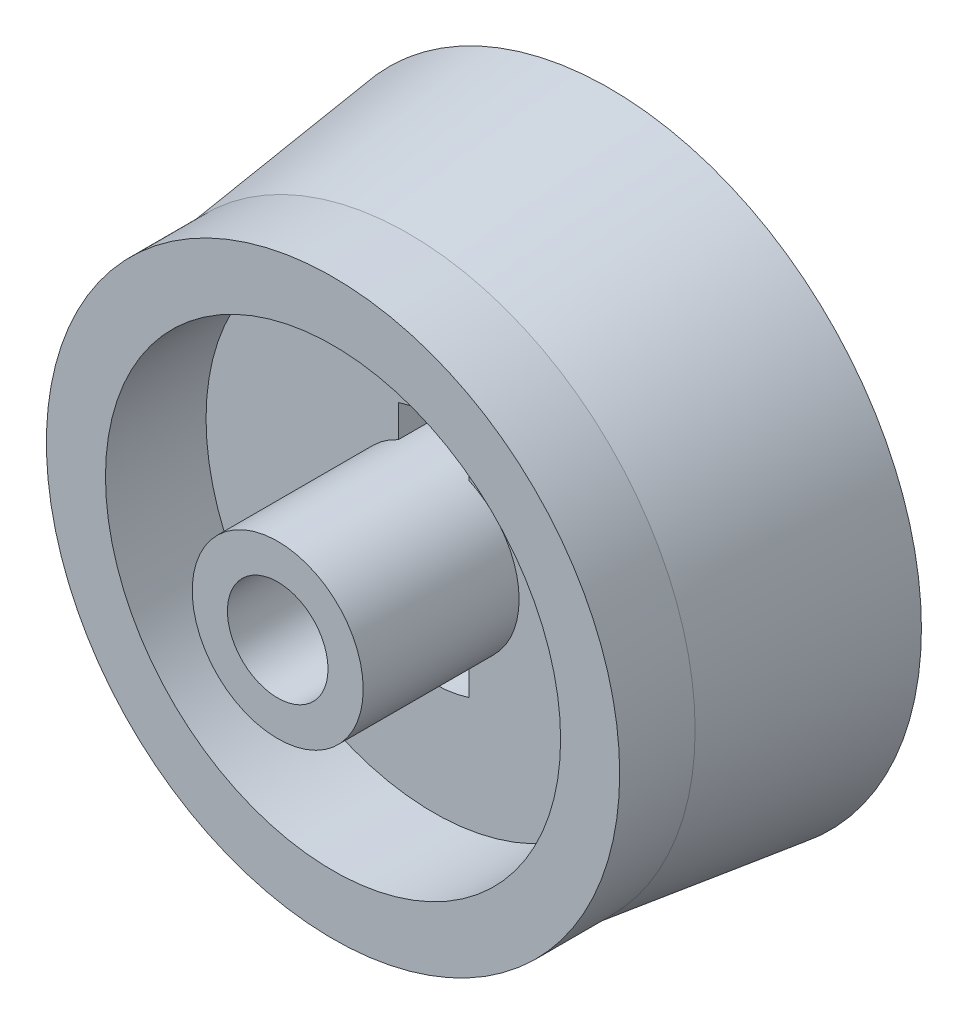
ISO-10303-21;
HEADER;
FILE_DESCRIPTION(('STEP AP214'),'2;1');
FILE_NAME('part.step','',(''),(''),'','','');
FILE_SCHEMA(('AUTOMOTIVE_DESIGN { 1 0 10303 214 1 1 1 1 }'));
ENDSEC;
DATA;
#1=APPLICATION_CONTEXT('core data for automotive mechanical design processes');
#2=APPLICATION_PROTOCOL_DEFINITION('international standard','automotive_design',2000,#1);
#3=PRODUCT_CONTEXT('',#1,'mechanical');
#4=PRODUCT('Part','Part','',(#3));
#5=PRODUCT_RELATED_PRODUCT_CATEGORY('part','',(#4));
#6=PRODUCT_DEFINITION_FORMATION('','',#4);
#7=PRODUCT_DEFINITION_CONTEXT('part definition',#1,'design');
#8=PRODUCT_DEFINITION('design','',#6,#7);
#9=PRODUCT_DEFINITION_SHAPE('','',#8);
#10=(LENGTH_UNIT() NAMED_UNIT(*) SI_UNIT(.MILLI.,.METRE.));
#11=(NAMED_UNIT(*) PLANE_ANGLE_UNIT() SI_UNIT($,.RADIAN.));
#12=(NAMED_UNIT(*) SI_UNIT($,.STERADIAN.) SOLID_ANGLE_UNIT());
#13=UNCERTAINTY_MEASURE_WITH_UNIT(LENGTH_MEASURE(1.E-05),#10,'distance_accuracy_value','');
#14=(GEOMETRIC_REPRESENTATION_CONTEXT(3) GLOBAL_UNCERTAINTY_ASSIGNED_CONTEXT((#13)) GLOBAL_UNIT_ASSIGNED_CONTEXT((#10,
#11,#12)) REPRESENTATION_CONTEXT('',''));
#15=CARTESIAN_POINT('',(0.,0.,0.));
#16=DIRECTION('',(0.,0.,1.));
#17=DIRECTION('',(1.,0.,0.));
#18=AXIS2_PLACEMENT_3D('',#15,#16,#17);
#19=CARTESIAN_POINT('',(0.,0.,1000.));
#20=DIRECTION('',(0.,0.,1.));
#21=DIRECTION('',(1.,0.,0.));
#22=AXIS2_PLACEMENT_3D('',#19,#20,#21);
#23=CYLINDRICAL_SURFACE('',#22,4.9);
#24=CARTESIAN_POINT('',(0.,0.,-3.20000000000009));
#25=DIRECTION('',(0.,0.,-1.));
#26=DIRECTION('',(-1.,0.,0.));
#27=AXIS2_PLACEMENT_3D('',#24,#25,#26);
#28=CIRCLE('',#27,4.9);
#29=CARTESIAN_POINT('',(-4.9,0.,-3.20000000000009));
#30=VERTEX_POINT('',#29);
#31=EDGE_CURVE('E154',#30,#30,#28,.T.);
#32=ORIENTED_EDGE('',*,*,#31,.F.);
#33=EDGE_LOOP('',(#32));
#34=FACE_BOUND('',#33,.T.);
#35=CARTESIAN_POINT('',(0.,0.,-4.79999999999992));
#36=DIRECTION('',(0.,0.,-1.));
#37=DIRECTION('',(-1.,0.,0.));
#38=AXIS2_PLACEMENT_3D('',#35,#36,#37);
#39=CIRCLE('',#38,4.9);
#40=CARTESIAN_POINT('',(-4.9,0.,-4.79999999999992));
#41=VERTEX_POINT('',#40);
#42=EDGE_CURVE('E41',#41,#41,#39,.F.);
#43=ORIENTED_EDGE('',*,*,#42,.F.);
#44=EDGE_LOOP('',(#43));
#45=FACE_BOUND('',#44,.T.);
#46=ADVANCED_FACE('F37',(#34,#45),#23,.F.);
#47=CARTESIAN_POINT('',(0.,0.,-3.2));
#48=DIRECTION('',(0.,0.,-1.));
#49=DIRECTION('',(-1.,0.,0.));
#50=AXIS2_PLACEMENT_3D('',#47,#48,#49);
#51=PLANE('',#50);
#52=DIRECTION('',(0.,1.,0.));
#53=VECTOR('',#52,1.);
#54=CARTESIAN_POINT('',(0.7,0.,-3.2));
#55=LINE('',#54,#53);
#56=CARTESIAN_POINT('',(0.7,-2.19089023002066,-3.2));
#57=VERTEX_POINT('',#56);
#58=CARTESIAN_POINT('',(0.7,-1.54919333848297,-3.2));
#59=VERTEX_POINT('',#58);
#60=EDGE_CURVE('E123',#57,#59,#55,.T.);
#61=ORIENTED_EDGE('',*,*,#60,.T.);
#62=CARTESIAN_POINT('',(0.,0.,-3.2));
#63=DIRECTION('',(0.,0.,-1.));
#64=DIRECTION('',(-1.,0.,0.));
#65=AXIS2_PLACEMENT_3D('',#62,#63,#64);
#66=CIRCLE('',#65,1.7);
#67=CARTESIAN_POINT('',(-0.7,-1.54919333848297,-3.2));
#68=VERTEX_POINT('',#67);
#69=EDGE_CURVE('E159',#59,#68,#66,.T.);
#70=ORIENTED_EDGE('',*,*,#69,.T.);
#71=DIRECTION('',(0.,1.,0.));
#72=VECTOR('',#71,1.);
#73=CARTESIAN_POINT('',(-0.7,0.,-3.2));
#74=LINE('',#73,#72);
#75=CARTESIAN_POINT('',(-0.7,-2.19089023002066,-3.2));
#76=VERTEX_POINT('',#75);
#77=EDGE_CURVE('E109',#76,#68,#74,.T.);
#78=ORIENTED_EDGE('',*,*,#77,.F.);
#79=CARTESIAN_POINT('',(0.,0.,-3.2));
#80=DIRECTION('',(0.,0.,-1.));
#81=DIRECTION('',(-1.,0.,0.));
#82=AXIS2_PLACEMENT_3D('',#79,#80,#81);
#83=CIRCLE('',#82,2.3);
#84=EDGE_CURVE('E166',#57,#76,#83,.T.);
#85=ORIENTED_EDGE('',*,*,#84,.F.);
#86=EDGE_LOOP('',(#61,#70,#78,#85));
#87=FACE_BOUND('',#86,.T.);
#88=CARTESIAN_POINT('',(0.,0.,-3.2));
#89=DIRECTION('',(0.,0.,-1.));
#90=DIRECTION('',(-1.,0.,0.));
#91=AXIS2_PLACEMENT_3D('',#88,#89,#90);
#92=CIRCLE('',#91,2.3);
#93=CARTESIAN_POINT('',(-0.7,2.19089023002066,-3.2));
#94=VERTEX_POINT('',#93);
#95=CARTESIAN_POINT('',(0.7,2.19089023002066,-3.2));
#96=VERTEX_POINT('',#95);
#97=EDGE_CURVE('E172',#94,#96,#92,.T.);
#98=ORIENTED_EDGE('',*,*,#97,.F.);
#99=DIRECTION('',(0.,1.,0.));
#100=VECTOR('',#99,1.);
#101=CARTESIAN_POINT('',(-0.7,0.,-3.2));
#102=LINE('',#101,#100);
#103=CARTESIAN_POINT('',(-0.7,1.54919333848297,-3.2));
#104=VERTEX_POINT('',#103);
#105=EDGE_CURVE('E170',#104,#94,#102,.T.);
#106=ORIENTED_EDGE('',*,*,#105,.F.);
#107=CARTESIAN_POINT('',(0.,0.,-3.2));
#108=DIRECTION('',(0.,0.,-1.));
#109=DIRECTION('',(-1.,0.,0.));
#110=AXIS2_PLACEMENT_3D('',#107,#108,#109);
#111=CIRCLE('',#110,1.7);
#112=CARTESIAN_POINT('',(0.7,1.54919333848297,-3.2));
#113=VERTEX_POINT('',#112);
#114=EDGE_CURVE('E178',#104,#113,#111,.T.);
#115=ORIENTED_EDGE('',*,*,#114,.T.);
#116=DIRECTION('',(0.,1.,0.));
#117=VECTOR('',#116,1.);
#118=CARTESIAN_POINT('',(0.7,0.,-3.2));
#119=LINE('',#118,#117);
#120=EDGE_CURVE('E175',#113,#96,#119,.T.);
#121=ORIENTED_EDGE('',*,*,#120,.T.);
#122=EDGE_LOOP('',(#98,#106,#115,#121));
#123=FACE_BOUND('',#122,.T.);
#124=CARTESIAN_POINT('',(0.,0.,-3.2));
#125=DIRECTION('',(0.,0.,-1.));
#126=DIRECTION('',(-1.,0.,0.));
#127=AXIS2_PLACEMENT_3D('',#124,#125,#126);
#128=CIRCLE('',#127,1.15);
#129=CARTESIAN_POINT('',(-1.15,0.,-3.2));
#130=VERTEX_POINT('',#129);
#131=EDGE_CURVE('E149',#130,#130,#128,.T.);
#132=ORIENTED_EDGE('',*,*,#131,.F.);
#133=EDGE_LOOP('',(#132));
#134=FACE_BOUND('',#133,.T.);
#135=ORIENTED_EDGE('',*,*,#31,.T.);
#136=EDGE_LOOP('',(#135));
#137=FACE_BOUND('',#136,.T.);
#138=ADVANCED_FACE('F214',(#87,#123,#134,#137),#51,.T.);
#139=CARTESIAN_POINT('',(0.,0.,-2.));
#140=DIRECTION('',(0.,0.,-1.));
#141=DIRECTION('',(-1.,0.,0.));
#142=AXIS2_PLACEMENT_3D('',#139,#140,#141);
#143=PLANE('',#142);
#144=CARTESIAN_POINT('',(0.,0.,-2.));
#145=DIRECTION('',(0.,0.,-1.));
#146=DIRECTION('',(-1.,0.,0.));
#147=AXIS2_PLACEMENT_3D('',#144,#145,#146);
#148=CIRCLE('',#147,1.7);
#149=CARTESIAN_POINT('',(0.7,-1.54919333848297,-2.));
#150=VERTEX_POINT('',#149);
#151=CARTESIAN_POINT('',(0.7,1.54919333848297,-2.));
#152=VERTEX_POINT('',#151);
#153=EDGE_CURVE('E131',#150,#152,#148,.F.);
#154=ORIENTED_EDGE('',*,*,#153,.F.);
#155=DIRECTION('',(0.,1.,0.));
#156=VECTOR('',#155,1.);
#157=CARTESIAN_POINT('',(0.7,0.,-2.));
#158=LINE('',#157,#156);
#159=CARTESIAN_POINT('',(0.7,-2.19089023002066,-2.));
#160=VERTEX_POINT('',#159);
#161=EDGE_CURVE('E53',#160,#150,#158,.T.);
#162=ORIENTED_EDGE('',*,*,#161,.F.);
#163=CARTESIAN_POINT('',(0.,0.,-2.));
#164=DIRECTION('',(0.,0.,-1.));
#165=DIRECTION('',(-1.,0.,0.));
#166=AXIS2_PLACEMENT_3D('',#163,#164,#165);
#167=CIRCLE('',#166,2.3);
#168=CARTESIAN_POINT('',(-0.7,-2.19089023002066,-2.));
#169=VERTEX_POINT('',#168);
#170=EDGE_CURVE('E122',#160,#169,#167,.T.);
#171=ORIENTED_EDGE('',*,*,#170,.T.);
#172=DIRECTION('',(0.,1.,0.));
#173=VECTOR('',#172,1.);
#174=CARTESIAN_POINT('',(-0.7,0.,-2.));
#175=LINE('',#174,#173);
#176=CARTESIAN_POINT('',(-0.7,-1.54919333848297,-2.));
#177=VERTEX_POINT('',#176);
#178=EDGE_CURVE('E106',#169,#177,#175,.T.);
#179=ORIENTED_EDGE('',*,*,#178,.T.);
#180=CARTESIAN_POINT('',(-0.7,1.54919333848297,-2.));
#181=VERTEX_POINT('',#180);
#182=EDGE_CURVE('E120',#181,#177,#148,.F.);
#183=ORIENTED_EDGE('',*,*,#182,.F.);
#184=DIRECTION('',(0.,1.,0.));
#185=VECTOR('',#184,1.);
#186=CARTESIAN_POINT('',(-0.7,0.,-2.));
#187=LINE('',#186,#185);
#188=CARTESIAN_POINT('',(-0.7,2.19089023002066,-2.));
#189=VERTEX_POINT('',#188);
#190=EDGE_CURVE('E163',#181,#189,#187,.T.);
#191=ORIENTED_EDGE('',*,*,#190,.T.);
#192=CARTESIAN_POINT('',(0.,0.,-2.));
#193=DIRECTION('',(0.,0.,-1.));
#194=DIRECTION('',(-1.,0.,0.));
#195=AXIS2_PLACEMENT_3D('',#192,#193,#194);
#196=CIRCLE('',#195,2.3);
#197=CARTESIAN_POINT('',(0.7,2.19089023002066,-2.));
#198=VERTEX_POINT('',#197);
#199=EDGE_CURVE('E182',#189,#198,#196,.T.);
#200=ORIENTED_EDGE('',*,*,#199,.T.);
#201=DIRECTION('',(0.,1.,0.));
#202=VECTOR('',#201,1.);
#203=CARTESIAN_POINT('',(0.7,0.,-2.));
#204=LINE('',#203,#202);
#205=EDGE_CURVE('E173',#152,#198,#204,.T.);
#206=ORIENTED_EDGE('',*,*,#205,.F.);
#207=EDGE_LOOP('',(#154,#162,#171,#179,#183,#191,#200,#206));
#208=FACE_BOUND('',#207,.T.);
#209=CARTESIAN_POINT('',(0.,0.,-2.));
#210=DIRECTION('',(0.,0.,-1.));
#211=DIRECTION('',(-1.,0.,0.));
#212=AXIS2_PLACEMENT_3D('',#209,#210,#211);
#213=CIRCLE('',#212,4.525);
#214=CARTESIAN_POINT('',(-4.525,0.,-2.));
#215=VERTEX_POINT('',#214);
#216=EDGE_CURVE('E12',#215,#215,#213,.T.);
#217=ORIENTED_EDGE('',*,*,#216,.F.);
#218=EDGE_LOOP('',(#217));
#219=FACE_BOUND('',#218,.T.);
#220=ADVANCED_FACE('F117',(#208,#219),#143,.F.);
#221=CARTESIAN_POINT('',(0.,0.,-2.));
#222=DIRECTION('',(0.,0.,1.));
#223=DIRECTION('',(1.,0.,0.));
#224=AXIS2_PLACEMENT_3D('',#221,#222,#223);
#225=CYLINDRICAL_SURFACE('',#224,1.);
#226=CARTESIAN_POINT('',(0.,0.,-2.1));
#227=DIRECTION('',(0.,0.,1.));
#228=DIRECTION('',(1.,0.,0.));
#229=AXIS2_PLACEMENT_3D('',#226,#227,#228);
#230=CIRCLE('',#229,1.);
#231=CARTESIAN_POINT('',(1.,0.,-2.1));
#232=VERTEX_POINT('',#231);
#233=EDGE_CURVE('E141',#232,#232,#230,.F.);
#234=ORIENTED_EDGE('',*,*,#233,.T.);
#235=EDGE_LOOP('',(#234));
#236=FACE_BOUND('',#235,.T.);
#237=CARTESIAN_POINT('',(0.,0.,1.1));
#238=DIRECTION('',(0.,0.,1.));
#239=DIRECTION('',(1.,0.,0.));
#240=AXIS2_PLACEMENT_3D('',#237,#238,#239);
#241=CIRCLE('',#240,1.);
#242=CARTESIAN_POINT('',(1.,0.,1.1));
#243=VERTEX_POINT('',#242);
#244=EDGE_CURVE('E130',#243,#243,#241,.T.);
#245=ORIENTED_EDGE('',*,*,#244,.T.);
#246=EDGE_LOOP('',(#245));
#247=FACE_BOUND('',#246,.T.);
#248=ADVANCED_FACE('F39',(#236,#247),#225,.F.);
#249=CARTESIAN_POINT('',(0.,0.,-2.));
#250=DIRECTION('',(0.,0.,1.));
#251=DIRECTION('',(1.,0.,0.));
#252=AXIS2_PLACEMENT_3D('',#249,#250,#251);
#253=CYLINDRICAL_SURFACE('',#252,1.7);
#254=ORIENTED_EDGE('',*,*,#182,.T.);
#255=DIRECTION('',(0.,0.,1.));
#256=VECTOR('',#255,1.);
#257=CARTESIAN_POINT('',(-0.7,-1.54919333848297,-3.2));
#258=LINE('',#257,#256);
#259=EDGE_CURVE('E61',#68,#177,#258,.T.);
#260=ORIENTED_EDGE('',*,*,#259,.F.);
#261=ORIENTED_EDGE('',*,*,#69,.F.);
#262=DIRECTION('',(0.,0.,1.));
#263=VECTOR('',#262,1.);
#264=CARTESIAN_POINT('',(0.7,-1.54919333848297,-3.2));
#265=LINE('',#264,#263);
#266=EDGE_CURVE('E111',#59,#150,#265,.T.);
#267=ORIENTED_EDGE('',*,*,#266,.T.);
#268=ORIENTED_EDGE('',*,*,#153,.T.);
#269=DIRECTION('',(0.,0.,1.));
#270=VECTOR('',#269,1.);
#271=CARTESIAN_POINT('',(0.7,1.54919333848297,-3.2));
#272=LINE('',#271,#270);
#273=EDGE_CURVE('E188',#113,#152,#272,.T.);
#274=ORIENTED_EDGE('',*,*,#273,.F.);
#275=ORIENTED_EDGE('',*,*,#114,.F.);
#276=DIRECTION('',(0.,0.,1.));
#277=VECTOR('',#276,1.);
#278=CARTESIAN_POINT('',(-0.7,1.54919333848297,-3.2));
#279=LINE('',#278,#277);
#280=EDGE_CURVE('E129',#104,#181,#279,.T.);
#281=ORIENTED_EDGE('',*,*,#280,.T.);
#282=EDGE_LOOP('',(#254,#260,#261,#267,#268,#274,#275,#281));
#283=FACE_BOUND('',#282,.T.);
#284=CARTESIAN_POINT('',(0.,0.,1.1));
#285=DIRECTION('',(0.,0.,1.));
#286=DIRECTION('',(1.,0.,0.));
#287=AXIS2_PLACEMENT_3D('',#284,#285,#286);
#288=CIRCLE('',#287,1.7);
#289=CARTESIAN_POINT('',(1.7,0.,1.1));
#290=VERTEX_POINT('',#289);
#291=EDGE_CURVE('E46',#290,#290,#288,.T.);
#292=ORIENTED_EDGE('',*,*,#291,.F.);
#293=EDGE_LOOP('',(#292));
#294=FACE_BOUND('',#293,.T.);
#295=ADVANCED_FACE('F126',(#283,#294),#253,.T.);
#296=CARTESIAN_POINT('',(0.,0.,1.1));
#297=DIRECTION('',(0.,0.,1.));
#298=DIRECTION('',(1.,0.,0.));
#299=AXIS2_PLACEMENT_3D('',#296,#297,#298);
#300=PLANE('',#299);
#301=ORIENTED_EDGE('',*,*,#244,.F.);
#302=EDGE_LOOP('',(#301));
#303=FACE_BOUND('',#302,.T.);
#304=ORIENTED_EDGE('',*,*,#291,.T.);
#305=EDGE_LOOP('',(#304));
#306=FACE_BOUND('',#305,.T.);
#307=ADVANCED_FACE('F211',(#303,#306),#300,.T.);
#308=CARTESIAN_POINT('',(-0.7,0.,-3.2));
#309=DIRECTION('',(1.,0.,0.));
#310=DIRECTION('',(0.,0.,-1.));
#311=AXIS2_PLACEMENT_3D('',#308,#309,#310);
#312=PLANE('',#311);
#313=ORIENTED_EDGE('',*,*,#190,.F.);
#314=ORIENTED_EDGE('',*,*,#280,.F.);
#315=ORIENTED_EDGE('',*,*,#105,.T.);
#316=DIRECTION('',(0.,0.,1.));
#317=VECTOR('',#316,1.);
#318=CARTESIAN_POINT('',(-0.7,2.19089023002066,-3.2));
#319=LINE('',#318,#317);
#320=EDGE_CURVE('E135',#94,#189,#319,.T.);
#321=ORIENTED_EDGE('',*,*,#320,.T.);
#322=EDGE_LOOP('',(#313,#314,#315,#321));
#323=FACE_BOUND('',#322,.T.);
#324=ADVANCED_FACE('F196',(#323),#312,.T.);
#325=CARTESIAN_POINT('',(0.,0.,-3.2));
#326=DIRECTION('',(0.,0.,1.));
#327=DIRECTION('',(1.,0.,0.));
#328=AXIS2_PLACEMENT_3D('',#325,#326,#327);
#329=CYLINDRICAL_SURFACE('',#328,2.3);
#330=ORIENTED_EDGE('',*,*,#199,.F.);
#331=ORIENTED_EDGE('',*,*,#320,.F.);
#332=ORIENTED_EDGE('',*,*,#97,.T.);
#333=DIRECTION('',(0.,0.,1.));
#334=VECTOR('',#333,1.);
#335=CARTESIAN_POINT('',(0.7,2.19089023002066,-3.2));
#336=LINE('',#335,#334);
#337=EDGE_CURVE('E190',#96,#198,#336,.T.);
#338=ORIENTED_EDGE('',*,*,#337,.T.);
#339=EDGE_LOOP('',(#330,#331,#332,#338));
#340=FACE_BOUND('',#339,.T.);
#341=ADVANCED_FACE('F200',(#340),#329,.F.);
#342=CARTESIAN_POINT('',(0.7,0.,-3.2));
#343=DIRECTION('',(1.,0.,0.));
#344=DIRECTION('',(0.,0.,-1.));
#345=AXIS2_PLACEMENT_3D('',#342,#343,#344);
#346=PLANE('',#345);
#347=ORIENTED_EDGE('',*,*,#205,.T.);
#348=ORIENTED_EDGE('',*,*,#337,.F.);
#349=ORIENTED_EDGE('',*,*,#120,.F.);
#350=ORIENTED_EDGE('',*,*,#273,.T.);
#351=EDGE_LOOP('',(#347,#348,#349,#350));
#352=FACE_BOUND('',#351,.T.);
#353=ADVANCED_FACE('F202',(#352),#346,.F.);
#354=CARTESIAN_POINT('',(0.7,0.,-3.2));
#355=DIRECTION('',(1.,0.,0.));
#356=DIRECTION('',(0.,0.,-1.));
#357=AXIS2_PLACEMENT_3D('',#354,#355,#356);
#358=PLANE('',#357);
#359=ORIENTED_EDGE('',*,*,#161,.T.);
#360=ORIENTED_EDGE('',*,*,#266,.F.);
#361=ORIENTED_EDGE('',*,*,#60,.F.);
#362=DIRECTION('',(0.,0.,1.));
#363=VECTOR('',#362,1.);
#364=CARTESIAN_POINT('',(0.7,-2.19089023002066,-3.2));
#365=LINE('',#364,#363);
#366=EDGE_CURVE('E143',#57,#160,#365,.T.);
#367=ORIENTED_EDGE('',*,*,#366,.T.);
#368=EDGE_LOOP('',(#359,#360,#361,#367));
#369=FACE_BOUND('',#368,.T.);
#370=ADVANCED_FACE('F208',(#369),#358,.F.);
#371=CARTESIAN_POINT('',(0.,0.,-3.2));
#372=DIRECTION('',(0.,0.,1.));
#373=DIRECTION('',(1.,0.,0.));
#374=AXIS2_PLACEMENT_3D('',#371,#372,#373);
#375=CYLINDRICAL_SURFACE('',#374,2.3);
#376=ORIENTED_EDGE('',*,*,#170,.F.);
#377=ORIENTED_EDGE('',*,*,#366,.F.);
#378=ORIENTED_EDGE('',*,*,#84,.T.);
#379=DIRECTION('',(0.,0.,1.));
#380=VECTOR('',#379,1.);
#381=CARTESIAN_POINT('',(-0.7,-2.19089023002066,-3.2));
#382=LINE('',#381,#380);
#383=EDGE_CURVE('E112',#76,#169,#382,.T.);
#384=ORIENTED_EDGE('',*,*,#383,.T.);
#385=EDGE_LOOP('',(#376,#377,#378,#384));
#386=FACE_BOUND('',#385,.T.);
#387=ADVANCED_FACE('F245',(#386),#375,.F.);
#388=CARTESIAN_POINT('',(-0.7,0.,-3.2));
#389=DIRECTION('',(1.,0.,0.));
#390=DIRECTION('',(0.,0.,-1.));
#391=AXIS2_PLACEMENT_3D('',#388,#389,#390);
#392=PLANE('',#391);
#393=ORIENTED_EDGE('',*,*,#178,.F.);
#394=ORIENTED_EDGE('',*,*,#383,.F.);
#395=ORIENTED_EDGE('',*,*,#77,.T.);
#396=ORIENTED_EDGE('',*,*,#259,.T.);
#397=EDGE_LOOP('',(#393,#394,#395,#396));
#398=FACE_BOUND('',#397,.T.);
#399=ADVANCED_FACE('F104',(#398),#392,.T.);
#400=CARTESIAN_POINT('',(0.,0.,-2.1));
#401=DIRECTION('',(0.,0.,1.));
#402=DIRECTION('',(1.,0.,0.));
#403=AXIS2_PLACEMENT_3D('',#400,#401,#402);
#404=PLANE('',#403);
#405=CARTESIAN_POINT('',(0.,0.,-2.1));
#406=DIRECTION('',(0.,0.,1.));
#407=DIRECTION('',(1.,0.,0.));
#408=AXIS2_PLACEMENT_3D('',#405,#406,#407);
#409=CIRCLE('',#408,1.15);
#410=CARTESIAN_POINT('',(1.15,0.,-2.1));
#411=VERTEX_POINT('',#410);
#412=EDGE_CURVE('E144',#411,#411,#409,.F.);
#413=ORIENTED_EDGE('',*,*,#412,.T.);
#414=EDGE_LOOP('',(#413));
#415=FACE_BOUND('',#414,.T.);
#416=ORIENTED_EDGE('',*,*,#233,.F.);
#417=EDGE_LOOP('',(#416));
#418=FACE_BOUND('',#417,.T.);
#419=ADVANCED_FACE('F239',(#415,#418),#404,.F.);
#420=CARTESIAN_POINT('',(0.,0.,4.35269119345812));
#421=DIRECTION('',(0.,0.,-1.));
#422=DIRECTION('',(-1.,0.,0.));
#423=AXIS2_PLACEMENT_3D('',#420,#421,#422);
#424=CYLINDRICAL_SURFACE('',#423,1.15);
#425=ORIENTED_EDGE('',*,*,#131,.T.);
#426=EDGE_LOOP('',(#425));
#427=FACE_BOUND('',#426,.T.);
#428=ORIENTED_EDGE('',*,*,#412,.F.);
#429=EDGE_LOOP('',(#428));
#430=FACE_BOUND('',#429,.T.);
#431=ADVANCED_FACE('F235',(#427,#430),#424,.F.);
#432=CARTESIAN_POINT('',(0.,0.,-1.50000000000006));
#433=DIRECTION('',(0.,0.,-1.));
#434=DIRECTION('',(-1.,0.,0.));
#435=AXIS2_PLACEMENT_3D('',#432,#433,#434);
#436=CONICAL_SURFACE('',#435,5.7,0.124354994546761);
#437=CARTESIAN_POINT('',(0.,0.,-5.50000000000006));
#438=DIRECTION('',(0.,0.,1.));
#439=DIRECTION('',(1.,0.,0.));
#440=AXIS2_PLACEMENT_3D('',#437,#438,#439);
#441=CIRCLE('',#440,6.2);
#442=CARTESIAN_POINT('',(6.2,0.,-5.50000000000006));
#443=VERTEX_POINT('',#442);
#444=EDGE_CURVE('E437',#443,#443,#441,.T.);
#445=ORIENTED_EDGE('',*,*,#444,.T.);
#446=EDGE_LOOP('',(#445));
#447=FACE_BOUND('',#446,.T.);
#448=CARTESIAN_POINT('',(0.,0.,-1.50000000000006));
#449=DIRECTION('',(0.,0.,1.));
#450=DIRECTION('',(1.,0.,0.));
#451=AXIS2_PLACEMENT_3D('',#448,#449,#450);
#452=CIRCLE('',#451,5.7);
#453=CARTESIAN_POINT('',(5.7,0.,-1.50000000000006));
#454=VERTEX_POINT('',#453);
#455=EDGE_CURVE('E440',#454,#454,#452,.T.);
#456=ORIENTED_EDGE('',*,*,#455,.F.);
#457=EDGE_LOOP('',(#456));
#458=FACE_BOUND('',#457,.T.);
#459=ADVANCED_FACE('F231',(#447,#458),#436,.T.);
#460=CARTESIAN_POINT('',(0.,0.,1000.));
#461=DIRECTION('',(0.,0.,1.));
#462=DIRECTION('',(1.,0.,0.));
#463=AXIS2_PLACEMENT_3D('',#460,#461,#462);
#464=CYLINDRICAL_SURFACE('',#463,4.525);
#465=ORIENTED_EDGE('',*,*,#216,.T.);
#466=EDGE_LOOP('',(#465));
#467=FACE_BOUND('',#466,.T.);
#468=CARTESIAN_POINT('',(0.,0.,0.));
#469=DIRECTION('',(0.,0.,1.));
#470=DIRECTION('',(1.,0.,0.));
#471=AXIS2_PLACEMENT_3D('',#468,#469,#470);
#472=CIRCLE('',#471,4.525);
#473=CARTESIAN_POINT('',(4.525,0.,0.));
#474=VERTEX_POINT('',#473);
#475=EDGE_CURVE('E431',#474,#474,#472,.T.);
#476=ORIENTED_EDGE('',*,*,#475,.T.);
#477=EDGE_LOOP('',(#476));
#478=FACE_BOUND('',#477,.T.);
#479=ADVANCED_FACE('F228',(#467,#478),#464,.F.);
#480=CARTESIAN_POINT('',(0.,0.,-5.5));
#481=DIRECTION('',(0.,0.,1.));
#482=DIRECTION('',(1.,0.,0.));
#483=AXIS2_PLACEMENT_3D('',#480,#481,#482);
#484=PLANE('',#483);
#485=CARTESIAN_POINT('',(0.,0.,-5.5));
#486=DIRECTION('',(0.,0.,-1.));
#487=DIRECTION('',(-1.,0.,0.));
#488=AXIS2_PLACEMENT_3D('',#485,#486,#487);
#489=CIRCLE('',#488,5.325);
#490=CARTESIAN_POINT('',(-5.325,0.,-5.5));
#491=VERTEX_POINT('',#490);
#492=EDGE_CURVE('E427',#491,#491,#489,.T.);
#493=ORIENTED_EDGE('',*,*,#492,.F.);
#494=EDGE_LOOP('',(#493));
#495=FACE_BOUND('',#494,.T.);
#496=ORIENTED_EDGE('',*,*,#444,.F.);
#497=EDGE_LOOP('',(#496));
#498=FACE_BOUND('',#497,.T.);
#499=ADVANCED_FACE('F226',(#495,#498),#484,.F.);
#500=CARTESIAN_POINT('',(0.,0.,-1.5));
#501=DIRECTION('',(0.,0.,1.));
#502=DIRECTION('',(1.,0.,0.));
#503=AXIS2_PLACEMENT_3D('',#500,#501,#502);
#504=CYLINDRICAL_SURFACE('',#503,5.7);
#505=ORIENTED_EDGE('',*,*,#455,.T.);
#506=EDGE_LOOP('',(#505));
#507=FACE_BOUND('',#506,.T.);
#508=CARTESIAN_POINT('',(0.,0.,0.));
#509=DIRECTION('',(0.,0.,1.));
#510=DIRECTION('',(1.,0.,0.));
#511=AXIS2_PLACEMENT_3D('',#508,#509,#510);
#512=CIRCLE('',#511,5.7);
#513=CARTESIAN_POINT('',(5.7,0.,0.));
#514=VERTEX_POINT('',#513);
#515=EDGE_CURVE('E434',#514,#514,#512,.T.);
#516=ORIENTED_EDGE('',*,*,#515,.F.);
#517=EDGE_LOOP('',(#516));
#518=FACE_BOUND('',#517,.T.);
#519=ADVANCED_FACE('F280',(#507,#518),#504,.T.);
#520=CARTESIAN_POINT('',(0.,0.,0.));
#521=DIRECTION('',(0.,0.,1.));
#522=DIRECTION('',(1.,0.,0.));
#523=AXIS2_PLACEMENT_3D('',#520,#521,#522);
#524=PLANE('',#523);
#525=ORIENTED_EDGE('',*,*,#475,.F.);
#526=EDGE_LOOP('',(#525));
#527=FACE_BOUND('',#526,.T.);
#528=ORIENTED_EDGE('',*,*,#515,.T.);
#529=EDGE_LOOP('',(#528));
#530=FACE_BOUND('',#529,.T.);
#531=ADVANCED_FACE('F287',(#527,#530),#524,.T.);
#532=CARTESIAN_POINT('',(0.,0.,-4.8));
#533=DIRECTION('',(0.,0.,-1.));
#534=DIRECTION('',(-1.,0.,0.));
#535=AXIS2_PLACEMENT_3D('',#532,#533,#534);
#536=PLANE('',#535);
#537=CARTESIAN_POINT('',(0.,0.,-4.8));
#538=DIRECTION('',(0.,0.,-1.));
#539=DIRECTION('',(-1.,0.,0.));
#540=AXIS2_PLACEMENT_3D('',#537,#538,#539);
#541=CIRCLE('',#540,5.325);
#542=CARTESIAN_POINT('',(-5.325,0.,-4.8));
#543=VERTEX_POINT('',#542);
#544=EDGE_CURVE('E424',#543,#543,#541,.T.);
#545=ORIENTED_EDGE('',*,*,#544,.T.);
#546=EDGE_LOOP('',(#545));
#547=FACE_BOUND('',#546,.T.);
#548=ORIENTED_EDGE('',*,*,#42,.T.);
#549=EDGE_LOOP('',(#548));
#550=FACE_BOUND('',#549,.T.);
#551=ADVANCED_FACE('F294',(#547,#550),#536,.T.);
#552=CARTESIAN_POINT('',(0.,0.,-4.8));
#553=DIRECTION('',(0.,0.,-1.));
#554=DIRECTION('',(-1.,0.,0.));
#555=AXIS2_PLACEMENT_3D('',#552,#553,#554);
#556=CYLINDRICAL_SURFACE('',#555,5.325);
#557=ORIENTED_EDGE('',*,*,#544,.F.);
#558=EDGE_LOOP('',(#557));
#559=FACE_BOUND('',#558,.T.);
#560=ORIENTED_EDGE('',*,*,#492,.T.);
#561=EDGE_LOOP('',(#560));
#562=FACE_BOUND('',#561,.T.);
#563=ADVANCED_FACE('F301',(#559,#562),#556,.F.);
#564=CLOSED_SHELL('',(#46,#138,#220,#248,#295,#307,#324,#341,#353,#370,#387,#399,#419,#431,#459,
#479,#499,#519,#531,#551,#563));
#565=MANIFOLD_SOLID_BREP('B2',#564);
#566=ADVANCED_BREP_SHAPE_REPRESENTATION('',(#18,#565),#14);
#567=SHAPE_DEFINITION_REPRESENTATION(#9,#566);
ENDSEC;
END-ISO-10303-21;
